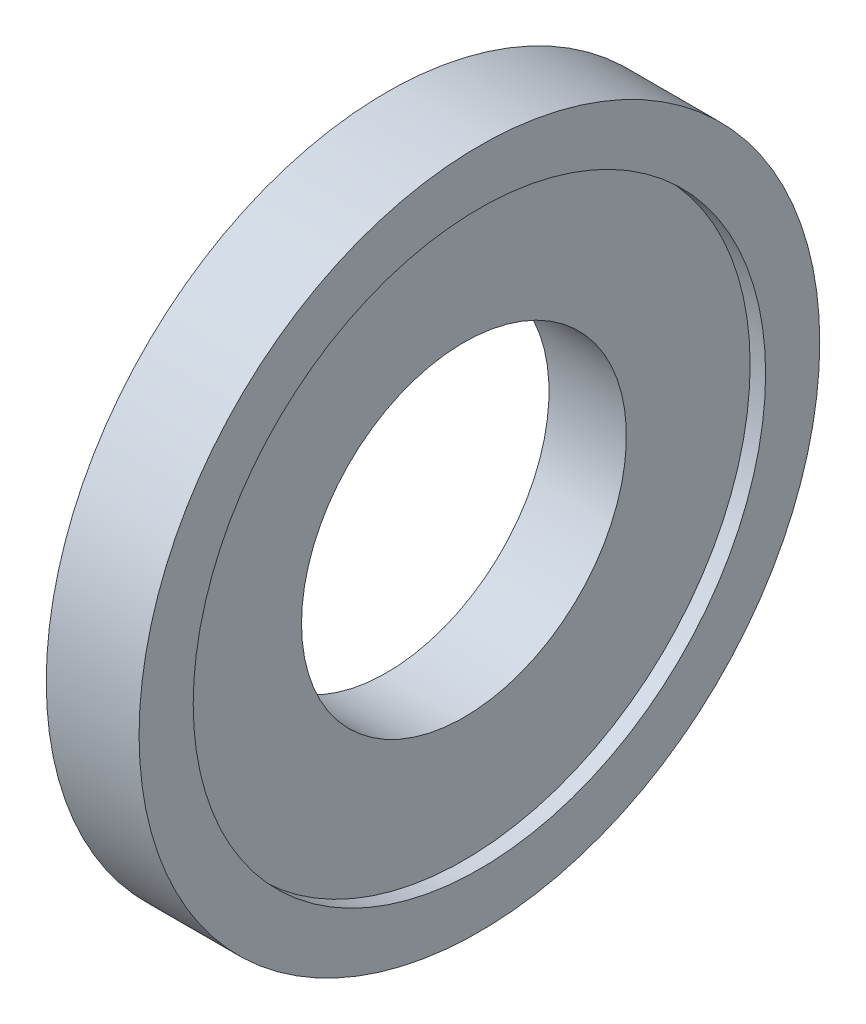
ISO-10303-21;
HEADER;
FILE_DESCRIPTION(('STEP AP214'),'2;1');
FILE_NAME('part.step','',(''),(''),'','','');
FILE_SCHEMA(('AUTOMOTIVE_DESIGN { 1 0 10303 214 1 1 1 1 }'));
ENDSEC;
DATA;
#1=APPLICATION_CONTEXT('core data for automotive mechanical design processes');
#2=APPLICATION_PROTOCOL_DEFINITION('international standard','automotive_design',2000,#1);
#3=PRODUCT_CONTEXT('',#1,'mechanical');
#4=PRODUCT('Part','Part','',(#3));
#5=PRODUCT_RELATED_PRODUCT_CATEGORY('part','',(#4));
#6=PRODUCT_DEFINITION_FORMATION('','',#4);
#7=PRODUCT_DEFINITION_CONTEXT('part definition',#1,'design');
#8=PRODUCT_DEFINITION('design','',#6,#7);
#9=PRODUCT_DEFINITION_SHAPE('','',#8);
#10=(LENGTH_UNIT() NAMED_UNIT(*) SI_UNIT(.MILLI.,.METRE.));
#11=(NAMED_UNIT(*) PLANE_ANGLE_UNIT() SI_UNIT($,.RADIAN.));
#12=(NAMED_UNIT(*) SI_UNIT($,.STERADIAN.) SOLID_ANGLE_UNIT());
#13=UNCERTAINTY_MEASURE_WITH_UNIT(LENGTH_MEASURE(1.E-05),#10,'distance_accuracy_value','');
#14=(GEOMETRIC_REPRESENTATION_CONTEXT(3) GLOBAL_UNCERTAINTY_ASSIGNED_CONTEXT((#13)) GLOBAL_UNIT_ASSIGNED_CONTEXT((#10,
#11,#12)) REPRESENTATION_CONTEXT('',''));
#15=CARTESIAN_POINT('',(0.,0.,0.));
#16=DIRECTION('',(0.,0.,1.));
#17=DIRECTION('',(1.,0.,0.));
#18=AXIS2_PLACEMENT_3D('',#15,#16,#17);
#19=CARTESIAN_POINT('',(0.,0.,0.));
#20=DIRECTION('',(-1.,0.,0.));
#21=DIRECTION('',(0.,0.,1.));
#22=AXIS2_PLACEMENT_3D('',#19,#20,#21);
#23=CYLINDRICAL_SURFACE('',#22,5.25);
#24=CARTESIAN_POINT('',(2.5,0.,0.));
#25=DIRECTION('',(-1.,0.,0.));
#26=DIRECTION('',(0.,0.,1.));
#27=AXIS2_PLACEMENT_3D('',#24,#25,#26);
#28=CIRCLE('',#27,5.25);
#29=CARTESIAN_POINT('',(2.5,0.,5.25));
#30=VERTEX_POINT('',#29);
#31=EDGE_CURVE('E55',#30,#30,#28,.T.);
#32=ORIENTED_EDGE('',*,*,#31,.F.);
#33=EDGE_LOOP('',(#32));
#34=FACE_BOUND('',#33,.T.);
#35=CARTESIAN_POINT('',(0.,0.,0.));
#36=DIRECTION('',(-1.,0.,0.));
#37=DIRECTION('',(0.,0.,1.));
#38=AXIS2_PLACEMENT_3D('',#35,#36,#37);
#39=CIRCLE('',#38,5.25);
#40=CARTESIAN_POINT('',(0.,0.,5.25));
#41=VERTEX_POINT('',#40);
#42=EDGE_CURVE('E10',#41,#41,#39,.T.);
#43=ORIENTED_EDGE('',*,*,#42,.T.);
#44=EDGE_LOOP('',(#43));
#45=FACE_BOUND('',#44,.T.);
#46=ADVANCED_FACE('F33',(#34,#45),#23,.F.);
#47=CARTESIAN_POINT('',(0.,5.25,0.));
#48=DIRECTION('',(1.,0.,0.));
#49=DIRECTION('',(0.,0.,-1.));
#50=AXIS2_PLACEMENT_3D('',#47,#48,#49);
#51=PLANE('',#50);
#52=ORIENTED_EDGE('',*,*,#42,.F.);
#53=EDGE_LOOP('',(#52));
#54=FACE_BOUND('',#53,.T.);
#55=CARTESIAN_POINT('',(0.,0.,0.));
#56=DIRECTION('',(-1.,0.,0.));
#57=DIRECTION('',(0.,0.,1.));
#58=AXIS2_PLACEMENT_3D('',#55,#56,#57);
#59=CIRCLE('',#58,11.);
#60=CARTESIAN_POINT('',(0.,0.,11.));
#61=VERTEX_POINT('',#60);
#62=EDGE_CURVE('E39',#61,#61,#59,.T.);
#63=ORIENTED_EDGE('',*,*,#62,.T.);
#64=EDGE_LOOP('',(#63));
#65=FACE_BOUND('',#64,.T.);
#66=ADVANCED_FACE('F62',(#54,#65),#51,.F.);
#67=CARTESIAN_POINT('',(0.,0.,0.));
#68=DIRECTION('',(-1.,0.,0.));
#69=DIRECTION('',(0.,0.,1.));
#70=AXIS2_PLACEMENT_3D('',#67,#68,#69);
#71=CYLINDRICAL_SURFACE('',#70,11.);
#72=ORIENTED_EDGE('',*,*,#62,.F.);
#73=EDGE_LOOP('',(#72));
#74=FACE_BOUND('',#73,.T.);
#75=CARTESIAN_POINT('',(3.,0.,0.));
#76=DIRECTION('',(-1.,0.,0.));
#77=DIRECTION('',(0.,0.,1.));
#78=AXIS2_PLACEMENT_3D('',#75,#76,#77);
#79=CIRCLE('',#78,11.);
#80=CARTESIAN_POINT('',(3.,0.,11.));
#81=VERTEX_POINT('',#80);
#82=EDGE_CURVE('E43',#81,#81,#79,.T.);
#83=ORIENTED_EDGE('',*,*,#82,.T.);
#84=EDGE_LOOP('',(#83));
#85=FACE_BOUND('',#84,.T.);
#86=ADVANCED_FACE('F66',(#74,#85),#71,.T.);
#87=CARTESIAN_POINT('',(3.,11.,0.));
#88=DIRECTION('',(-1.,0.,0.));
#89=DIRECTION('',(0.,0.,1.));
#90=AXIS2_PLACEMENT_3D('',#87,#88,#89);
#91=PLANE('',#90);
#92=ORIENTED_EDGE('',*,*,#82,.F.);
#93=EDGE_LOOP('',(#92));
#94=FACE_BOUND('',#93,.T.);
#95=CARTESIAN_POINT('',(3.,0.,0.));
#96=DIRECTION('',(-1.,0.,0.));
#97=DIRECTION('',(0.,0.,1.));
#98=AXIS2_PLACEMENT_3D('',#95,#96,#97);
#99=CIRCLE('',#98,9.25);
#100=CARTESIAN_POINT('',(3.,0.,9.25));
#101=VERTEX_POINT('',#100);
#102=EDGE_CURVE('E47',#101,#101,#99,.T.);
#103=ORIENTED_EDGE('',*,*,#102,.T.);
#104=EDGE_LOOP('',(#103));
#105=FACE_BOUND('',#104,.T.);
#106=ADVANCED_FACE('F71',(#94,#105),#91,.F.);
#107=CARTESIAN_POINT('',(0.,0.,0.));
#108=DIRECTION('',(-1.,0.,0.));
#109=DIRECTION('',(0.,0.,1.));
#110=AXIS2_PLACEMENT_3D('',#107,#108,#109);
#111=CYLINDRICAL_SURFACE('',#110,9.25);
#112=ORIENTED_EDGE('',*,*,#102,.F.);
#113=EDGE_LOOP('',(#112));
#114=FACE_BOUND('',#113,.T.);
#115=CARTESIAN_POINT('',(2.5,0.,0.));
#116=DIRECTION('',(-1.,0.,0.));
#117=DIRECTION('',(0.,0.,1.));
#118=AXIS2_PLACEMENT_3D('',#115,#116,#117);
#119=CIRCLE('',#118,9.25);
#120=CARTESIAN_POINT('',(2.5,0.,9.25));
#121=VERTEX_POINT('',#120);
#122=EDGE_CURVE('E52',#121,#121,#119,.T.);
#123=ORIENTED_EDGE('',*,*,#122,.T.);
#124=EDGE_LOOP('',(#123));
#125=FACE_BOUND('',#124,.T.);
#126=ADVANCED_FACE('F77',(#114,#125),#111,.F.);
#127=CARTESIAN_POINT('',(2.5,9.25,0.));
#128=DIRECTION('',(-1.,0.,0.));
#129=DIRECTION('',(0.,0.,1.));
#130=AXIS2_PLACEMENT_3D('',#127,#128,#129);
#131=PLANE('',#130);
#132=ORIENTED_EDGE('',*,*,#122,.F.);
#133=EDGE_LOOP('',(#132));
#134=FACE_BOUND('',#133,.T.);
#135=ORIENTED_EDGE('',*,*,#31,.T.);
#136=EDGE_LOOP('',(#135));
#137=FACE_BOUND('',#136,.T.);
#138=ADVANCED_FACE('F59',(#134,#137),#131,.F.);
#139=CLOSED_SHELL('',(#46,#66,#86,#106,#126,#138));
#140=MANIFOLD_SOLID_BREP('B2',#139);
#141=ADVANCED_BREP_SHAPE_REPRESENTATION('',(#18,#140),#14);
#142=SHAPE_DEFINITION_REPRESENTATION(#9,#141);
ENDSEC;
END-ISO-10303-21;
